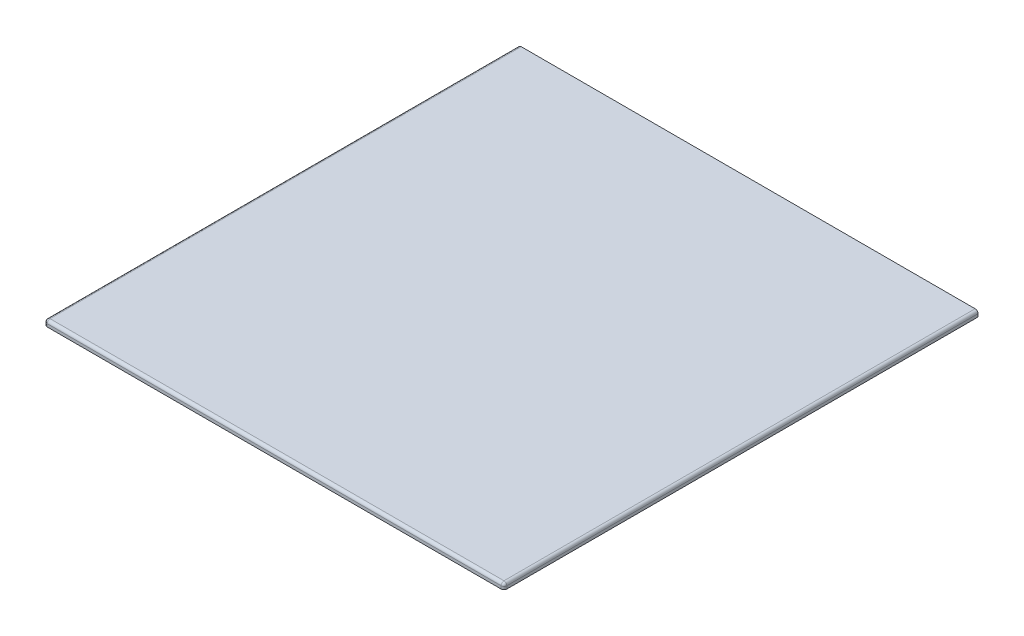
ISO-10303-21;
HEADER;
FILE_DESCRIPTION(('STEP AP214'),'2;1');
FILE_NAME('part.step','',(''),(''),'','','');
FILE_SCHEMA(('AUTOMOTIVE_DESIGN { 1 0 10303 214 1 1 1 1 }'));
ENDSEC;
DATA;
#1=APPLICATION_CONTEXT('core data for automotive mechanical design processes');
#2=APPLICATION_PROTOCOL_DEFINITION('international standard','automotive_design',2000,#1);
#3=PRODUCT_CONTEXT('',#1,'mechanical');
#4=PRODUCT('Part','Part','',(#3));
#5=PRODUCT_RELATED_PRODUCT_CATEGORY('part','',(#4));
#6=PRODUCT_DEFINITION_FORMATION('','',#4);
#7=PRODUCT_DEFINITION_CONTEXT('part definition',#1,'design');
#8=PRODUCT_DEFINITION('design','',#6,#7);
#9=PRODUCT_DEFINITION_SHAPE('','',#8);
#10=(LENGTH_UNIT() NAMED_UNIT(*) SI_UNIT(.MILLI.,.METRE.));
#11=(NAMED_UNIT(*) PLANE_ANGLE_UNIT() SI_UNIT($,.RADIAN.));
#12=(NAMED_UNIT(*) SI_UNIT($,.STERADIAN.) SOLID_ANGLE_UNIT());
#13=UNCERTAINTY_MEASURE_WITH_UNIT(LENGTH_MEASURE(1.E-05),#10,'distance_accuracy_value','');
#14=(GEOMETRIC_REPRESENTATION_CONTEXT(3) GLOBAL_UNCERTAINTY_ASSIGNED_CONTEXT((#13)) GLOBAL_UNIT_ASSIGNED_CONTEXT((#10,
#11,#12)) REPRESENTATION_CONTEXT('',''));
#15=CARTESIAN_POINT('',(0.,0.,0.));
#16=DIRECTION('',(0.,0.,1.));
#17=DIRECTION('',(1.,0.,0.));
#18=AXIS2_PLACEMENT_3D('',#15,#16,#17);
#19=CARTESIAN_POINT('',(508.,6.35,0.));
#20=DIRECTION('',(0.,1.,0.));
#21=DIRECTION('',(0.,0.,1.));
#22=AXIS2_PLACEMENT_3D('',#19,#20,#21);
#23=PLANE('',#22);
#24=DIRECTION('',(0.,0.,-1.));
#25=VECTOR('',#24,1.);
#26=CARTESIAN_POINT('',(3.175,6.35,1206.79845));
#27=LINE('',#26,#25);
#28=CARTESIAN_POINT('',(3.17500000000002,6.35,520.7));
#29=VERTEX_POINT('',#28);
#30=CARTESIAN_POINT('',(3.175,6.35,0.));
#31=VERTEX_POINT('',#30);
#32=EDGE_CURVE('E162',#29,#31,#27,.T.);
#33=ORIENTED_EDGE('',*,*,#32,.F.);
#34=DIRECTION('',(-1.,0.,0.));
#35=VECTOR('',#34,1.);
#36=CARTESIAN_POINT('',(505.94709213478,6.35,520.7));
#37=LINE('',#36,#35);
#38=CARTESIAN_POINT('',(504.825,6.35000000000001,520.700000000022));
#39=VERTEX_POINT('',#38);
#40=EDGE_CURVE('E166',#39,#29,#37,.T.);
#41=ORIENTED_EDGE('',*,*,#40,.F.);
#42=DIRECTION('',(0.,0.,-1.));
#43=VECTOR('',#42,1.);
#44=CARTESIAN_POINT('',(504.825,6.35,1206.79845));
#45=LINE('',#44,#43);
#46=CARTESIAN_POINT('',(504.825,6.35,0.));
#47=VERTEX_POINT('',#46);
#48=EDGE_CURVE('E93',#47,#39,#45,.F.);
#49=ORIENTED_EDGE('',*,*,#48,.F.);
#50=DIRECTION('',(1.,0.,0.));
#51=VECTOR('',#50,1.);
#52=CARTESIAN_POINT('',(0.,6.35,0.));
#53=LINE('',#52,#51);
#54=EDGE_CURVE('E136',#47,#31,#53,.F.);
#55=ORIENTED_EDGE('',*,*,#54,.T.);
#56=EDGE_LOOP('',(#33,#41,#49,#55));
#57=FACE_BOUND('',#56,.T.);
#58=ADVANCED_FACE('F16',(#57),#23,.T.);
#59=CARTESIAN_POINT('',(3.175,3.175,1206.79845));
#60=DIRECTION('',(0.,0.,-1.));
#61=DIRECTION('',(-1.,0.,0.));
#62=AXIS2_PLACEMENT_3D('',#59,#60,#61);
#63=CYLINDRICAL_SURFACE('',#62,3.175);
#64=DIRECTION('',(0.,0.,1.));
#65=VECTOR('',#64,1.);
#66=CARTESIAN_POINT('',(0.,3.17500000004318,0.));
#67=LINE('',#66,#65);
#68=CARTESIAN_POINT('',(0.,3.17500000002159,520.700000000195));
#69=VERTEX_POINT('',#68);
#70=CARTESIAN_POINT('',(0.,3.17500000002159,0.));
#71=VERTEX_POINT('',#70);
#72=EDGE_CURVE('E177',#69,#71,#67,.F.);
#73=ORIENTED_EDGE('',*,*,#72,.F.);
#74=CARTESIAN_POINT('',(3.17499999999998,3.17500000000004,520.7));
#75=DIRECTION('',(1.22590104734144E-10,1.22590104734144E-10,1.));
#76=DIRECTION('',(-0.707106781182498,0.707106781190598,0.));
#77=AXIS2_PLACEMENT_3D('',#74,#75,#76);
#78=CIRCLE('',#77,3.175);
#79=CARTESIAN_POINT('',(0.92993596974557,5.42006403028015,520.7));
#80=VERTEX_POINT('',#79);
#81=EDGE_CURVE('E141',#80,#69,#78,.T.);
#82=ORIENTED_EDGE('',*,*,#81,.F.);
#83=CARTESIAN_POINT('',(3.175,3.175,520.7));
#84=DIRECTION('',(0.,0.,-1.));
#85=DIRECTION('',(-1.,0.,0.));
#86=AXIS2_PLACEMENT_3D('',#83,#84,#85);
#87=CIRCLE('',#86,3.175);
#88=EDGE_CURVE('E180',#29,#80,#87,.F.);
#89=ORIENTED_EDGE('',*,*,#88,.F.);
#90=ORIENTED_EDGE('',*,*,#32,.T.);
#91=CARTESIAN_POINT('',(3.175,3.175,0.));
#92=DIRECTION('',(0.,0.,-1.));
#93=DIRECTION('',(-1.,0.,0.));
#94=AXIS2_PLACEMENT_3D('',#91,#92,#93);
#95=CIRCLE('',#94,3.175);
#96=EDGE_CURVE('E133',#31,#71,#95,.F.);
#97=ORIENTED_EDGE('',*,*,#96,.T.);
#98=EDGE_LOOP('',(#73,#82,#89,#90,#97));
#99=FACE_BOUND('',#98,.T.);
#100=ADVANCED_FACE('F214',(#99),#63,.T.);
#101=CARTESIAN_POINT('',(504.825,3.175,1206.79845));
#102=DIRECTION('',(0.,0.,-1.));
#103=DIRECTION('',(-1.,0.,0.));
#104=AXIS2_PLACEMENT_3D('',#101,#102,#103);
#105=CYLINDRICAL_SURFACE('',#104,3.175);
#106=ORIENTED_EDGE('',*,*,#48,.T.);
#107=CARTESIAN_POINT('',(504.825,3.17500000000004,520.7));
#108=DIRECTION('',(1.41821554500154E-11,-1.41821554500154E-11,1.));
#109=DIRECTION('',(0.707106781190598,0.707106781182498,0.));
#110=AXIS2_PLACEMENT_3D('',#107,#108,#109);
#111=CIRCLE('',#110,3.175);
#112=CARTESIAN_POINT('',(507.07006403028,5.42006403025443,520.7));
#113=VERTEX_POINT('',#112);
#114=EDGE_CURVE('E90',#113,#39,#111,.T.);
#115=ORIENTED_EDGE('',*,*,#114,.F.);
#116=CARTESIAN_POINT('',(504.825,3.175,520.7));
#117=DIRECTION('',(0.,0.,-1.));
#118=DIRECTION('',(-1.,0.,0.));
#119=AXIS2_PLACEMENT_3D('',#116,#117,#118);
#120=CIRCLE('',#119,3.175);
#121=CARTESIAN_POINT('',(508.,3.175,520.7));
#122=VERTEX_POINT('',#121);
#123=EDGE_CURVE('E19',#122,#113,#120,.F.);
#124=ORIENTED_EDGE('',*,*,#123,.F.);
#125=DIRECTION('',(0.,0.,-1.));
#126=VECTOR('',#125,1.);
#127=CARTESIAN_POINT('',(508.,3.175,0.));
#128=LINE('',#127,#126);
#129=CARTESIAN_POINT('',(508.,3.175,0.));
#130=VERTEX_POINT('',#129);
#131=EDGE_CURVE('E87',#130,#122,#128,.F.);
#132=ORIENTED_EDGE('',*,*,#131,.F.);
#133=CARTESIAN_POINT('',(504.825,3.175,0.));
#134=DIRECTION('',(0.,0.,-1.));
#135=DIRECTION('',(-1.,0.,0.));
#136=AXIS2_PLACEMENT_3D('',#133,#134,#135);
#137=CIRCLE('',#136,3.175);
#138=EDGE_CURVE('E138',#130,#47,#137,.F.);
#139=ORIENTED_EDGE('',*,*,#138,.T.);
#140=EDGE_LOOP('',(#106,#115,#124,#132,#139));
#141=FACE_BOUND('',#140,.T.);
#142=ADVANCED_FACE('F85',(#141),#105,.T.);
#143=CARTESIAN_POINT('',(504.825,3.175,520.7));
#144=DIRECTION('',(0.707106781190598,0.707106781182498,0.));
#145=DIRECTION('',(0.,0.,1.));
#146=AXIS2_PLACEMENT_3D('',#143,#144,#145);
#147=SPHERICAL_SURFACE('',#146,3.175);
#148=ORIENTED_EDGE('',*,*,#123,.T.);
#149=ORIENTED_EDGE('',*,*,#114,.T.);
#150=CARTESIAN_POINT('',(504.825,3.175,520.7));
#151=DIRECTION('',(-1.,0.,0.));
#152=DIRECTION('',(0.,0.,1.));
#153=AXIS2_PLACEMENT_3D('',#150,#151,#152);
#154=CIRCLE('',#153,3.175);
#155=CARTESIAN_POINT('',(504.825,3.175,523.875));
#156=VERTEX_POINT('',#155);
#157=EDGE_CURVE('E107',#156,#39,#154,.T.);
#158=ORIENTED_EDGE('',*,*,#157,.F.);
#159=CARTESIAN_POINT('',(504.825,3.175,520.7));
#160=DIRECTION('',(0.,1.,0.));
#161=DIRECTION('',(0.,0.,1.));
#162=AXIS2_PLACEMENT_3D('',#159,#160,#161);
#163=CIRCLE('',#162,3.175);
#164=EDGE_CURVE('E104',#122,#156,#163,.F.);
#165=ORIENTED_EDGE('',*,*,#164,.F.);
#166=EDGE_LOOP('',(#148,#149,#158,#165));
#167=FACE_BOUND('',#166,.T.);
#168=ADVANCED_FACE('F105',(#167),#147,.T.);
#169=CARTESIAN_POINT('',(505.94709213478,3.175,520.7));
#170=DIRECTION('',(-1.,0.,0.));
#171=DIRECTION('',(0.,0.,1.));
#172=AXIS2_PLACEMENT_3D('',#169,#170,#171);
#173=CYLINDRICAL_SURFACE('',#172,3.175);
#174=CARTESIAN_POINT('',(3.17500000000004,3.175,520.7));
#175=DIRECTION('',(-1.,0.,0.));
#176=DIRECTION('',(0.,0.,1.));
#177=AXIS2_PLACEMENT_3D('',#174,#175,#176);
#178=CIRCLE('',#177,3.175);
#179=CARTESIAN_POINT('',(3.17500000000002,3.175,523.875));
#180=VERTEX_POINT('',#179);
#181=EDGE_CURVE('E168',#180,#29,#178,.T.);
#182=ORIENTED_EDGE('',*,*,#181,.F.);
#183=DIRECTION('',(1.,0.,0.));
#184=VECTOR('',#183,1.);
#185=CARTESIAN_POINT('',(0.,3.175,523.875));
#186=LINE('',#185,#184);
#187=EDGE_CURVE('E160',#156,#180,#186,.F.);
#188=ORIENTED_EDGE('',*,*,#187,.F.);
#189=ORIENTED_EDGE('',*,*,#157,.T.);
#190=ORIENTED_EDGE('',*,*,#40,.T.);
#191=EDGE_LOOP('',(#182,#188,#189,#190));
#192=FACE_BOUND('',#191,.T.);
#193=ADVANCED_FACE('F149',(#192),#173,.T.);
#194=CARTESIAN_POINT('',(3.175,3.175,520.7));
#195=DIRECTION('',(-0.707106781182498,0.707106781190598,0.));
#196=DIRECTION('',(0.,0.,1.));
#197=AXIS2_PLACEMENT_3D('',#194,#195,#196);
#198=SPHERICAL_SURFACE('',#197,3.175);
#199=ORIENTED_EDGE('',*,*,#88,.T.);
#200=ORIENTED_EDGE('',*,*,#81,.T.);
#201=CARTESIAN_POINT('',(3.175,3.175,520.7));
#202=DIRECTION('',(0.,-1.,0.));
#203=DIRECTION('',(0.,0.,-1.));
#204=AXIS2_PLACEMENT_3D('',#201,#202,#203);
#205=CIRCLE('',#204,3.175);
#206=EDGE_CURVE('E171',#180,#69,#205,.T.);
#207=ORIENTED_EDGE('',*,*,#206,.F.);
#208=ORIENTED_EDGE('',*,*,#181,.T.);
#209=EDGE_LOOP('',(#199,#200,#207,#208));
#210=FACE_BOUND('',#209,.T.);
#211=ADVANCED_FACE('F144',(#210),#198,.T.);
#212=CARTESIAN_POINT('',(0.,6.35,0.));
#213=DIRECTION('',(-1.,0.,0.));
#214=DIRECTION('',(0.,0.,1.));
#215=AXIS2_PLACEMENT_3D('',#212,#213,#214);
#216=PLANE('',#215);
#217=DIRECTION('',(0.,0.,-1.));
#218=VECTOR('',#217,1.);
#219=CARTESIAN_POINT('',(0.,0.,0.));
#220=LINE('',#219,#218);
#221=CARTESIAN_POINT('',(0.,0.,520.7));
#222=VERTEX_POINT('',#221);
#223=CARTESIAN_POINT('',(0.,0.,0.));
#224=VERTEX_POINT('',#223);
#225=EDGE_CURVE('E128',#222,#224,#220,.T.);
#226=ORIENTED_EDGE('',*,*,#225,.F.);
#227=DIRECTION('',(0.,-1.,0.));
#228=VECTOR('',#227,1.);
#229=CARTESIAN_POINT('',(0.,4.29709213473682,520.7));
#230=LINE('',#229,#228);
#231=EDGE_CURVE('E173',#69,#222,#230,.T.);
#232=ORIENTED_EDGE('',*,*,#231,.F.);
#233=ORIENTED_EDGE('',*,*,#72,.T.);
#234=DIRECTION('',(0.,1.,0.));
#235=VECTOR('',#234,1.);
#236=CARTESIAN_POINT('',(0.,0.,0.));
#237=LINE('',#236,#235);
#238=EDGE_CURVE('E121',#71,#224,#237,.F.);
#239=ORIENTED_EDGE('',*,*,#238,.T.);
#240=EDGE_LOOP('',(#226,#232,#233,#239));
#241=FACE_BOUND('',#240,.T.);
#242=ADVANCED_FACE('F148',(#241),#216,.T.);
#243=CARTESIAN_POINT('',(0.,0.,0.));
#244=DIRECTION('',(0.,0.,1.));
#245=DIRECTION('',(1.,0.,0.));
#246=AXIS2_PLACEMENT_3D('',#243,#244,#245);
#247=PLANE('',#246);
#248=DIRECTION('',(1.,0.,0.));
#249=VECTOR('',#248,1.);
#250=CARTESIAN_POINT('',(0.,0.,0.));
#251=LINE('',#250,#249);
#252=CARTESIAN_POINT('',(508.,0.,0.));
#253=VERTEX_POINT('',#252);
#254=EDGE_CURVE('E124',#224,#253,#251,.T.);
#255=ORIENTED_EDGE('',*,*,#254,.F.);
#256=ORIENTED_EDGE('',*,*,#238,.F.);
#257=ORIENTED_EDGE('',*,*,#96,.F.);
#258=ORIENTED_EDGE('',*,*,#54,.F.);
#259=ORIENTED_EDGE('',*,*,#138,.F.);
#260=DIRECTION('',(0.,1.,0.));
#261=VECTOR('',#260,1.);
#262=CARTESIAN_POINT('',(508.,0.,0.));
#263=LINE('',#262,#261);
#264=EDGE_CURVE('E101',#253,#130,#263,.T.);
#265=ORIENTED_EDGE('',*,*,#264,.F.);
#266=EDGE_LOOP('',(#255,#256,#257,#258,#259,#265));
#267=FACE_BOUND('',#266,.T.);
#268=ADVANCED_FACE('F210',(#267),#247,.F.);
#269=CARTESIAN_POINT('',(508.,0.,0.));
#270=DIRECTION('',(1.,0.,0.));
#271=DIRECTION('',(0.,0.,-1.));
#272=AXIS2_PLACEMENT_3D('',#269,#270,#271);
#273=PLANE('',#272);
#274=ORIENTED_EDGE('',*,*,#131,.T.);
#275=DIRECTION('',(0.,1.,0.));
#276=VECTOR('',#275,1.);
#277=CARTESIAN_POINT('',(508.,-8.27786,520.7));
#278=LINE('',#277,#276);
#279=CARTESIAN_POINT('',(508.,0.,520.7));
#280=VERTEX_POINT('',#279);
#281=EDGE_CURVE('E98',#280,#122,#278,.T.);
#282=ORIENTED_EDGE('',*,*,#281,.F.);
#283=DIRECTION('',(0.,0.,-1.));
#284=VECTOR('',#283,1.);
#285=CARTESIAN_POINT('',(508.,0.,0.));
#286=LINE('',#285,#284);
#287=EDGE_CURVE('E127',#253,#280,#286,.F.);
#288=ORIENTED_EDGE('',*,*,#287,.F.);
#289=ORIENTED_EDGE('',*,*,#264,.T.);
#290=EDGE_LOOP('',(#274,#282,#288,#289));
#291=FACE_BOUND('',#290,.T.);
#292=ADVANCED_FACE('F95',(#291),#273,.T.);
#293=CARTESIAN_POINT('',(504.825,-8.27786,520.7));
#294=DIRECTION('',(0.,1.,0.));
#295=DIRECTION('',(0.,0.,1.));
#296=AXIS2_PLACEMENT_3D('',#293,#294,#295);
#297=CYLINDRICAL_SURFACE('',#296,3.175);
#298=DIRECTION('',(0.,1.,0.));
#299=VECTOR('',#298,1.);
#300=CARTESIAN_POINT('',(504.825,0.,523.875));
#301=LINE('',#300,#299);
#302=CARTESIAN_POINT('',(504.825,0.,523.875));
#303=VERTEX_POINT('',#302);
#304=EDGE_CURVE('E110',#303,#156,#301,.T.);
#305=ORIENTED_EDGE('',*,*,#304,.F.);
#306=CARTESIAN_POINT('',(504.825,0.,520.7));
#307=DIRECTION('',(0.,1.,0.));
#308=DIRECTION('',(0.,0.,1.));
#309=AXIS2_PLACEMENT_3D('',#306,#307,#308);
#310=CIRCLE('',#309,3.175);
#311=EDGE_CURVE('E114',#280,#303,#310,.F.);
#312=ORIENTED_EDGE('',*,*,#311,.F.);
#313=ORIENTED_EDGE('',*,*,#281,.T.);
#314=ORIENTED_EDGE('',*,*,#164,.T.);
#315=EDGE_LOOP('',(#305,#312,#313,#314));
#316=FACE_BOUND('',#315,.T.);
#317=ADVANCED_FACE('F112',(#316),#297,.T.);
#318=CARTESIAN_POINT('',(0.,0.,523.875));
#319=DIRECTION('',(0.,0.,1.));
#320=DIRECTION('',(1.,0.,0.));
#321=AXIS2_PLACEMENT_3D('',#318,#319,#320);
#322=PLANE('',#321);
#323=ORIENTED_EDGE('',*,*,#187,.T.);
#324=DIRECTION('',(0.,-1.,0.));
#325=VECTOR('',#324,1.);
#326=CARTESIAN_POINT('',(3.175,4.29709213473682,523.875));
#327=LINE('',#326,#325);
#328=CARTESIAN_POINT('',(3.175,0.,523.875));
#329=VERTEX_POINT('',#328);
#330=EDGE_CURVE('E34',#329,#180,#327,.F.);
#331=ORIENTED_EDGE('',*,*,#330,.F.);
#332=DIRECTION('',(1.,0.,0.));
#333=VECTOR('',#332,1.);
#334=CARTESIAN_POINT('',(0.,0.,523.875));
#335=LINE('',#334,#333);
#336=EDGE_CURVE('E25',#303,#329,#335,.F.);
#337=ORIENTED_EDGE('',*,*,#336,.F.);
#338=ORIENTED_EDGE('',*,*,#304,.T.);
#339=EDGE_LOOP('',(#323,#331,#337,#338));
#340=FACE_BOUND('',#339,.T.);
#341=ADVANCED_FACE('F188',(#340),#322,.T.);
#342=CARTESIAN_POINT('',(3.175,4.29709213473682,520.7));
#343=DIRECTION('',(0.,-1.,0.));
#344=DIRECTION('',(0.,0.,-1.));
#345=AXIS2_PLACEMENT_3D('',#342,#343,#344);
#346=CYLINDRICAL_SURFACE('',#345,3.175);
#347=ORIENTED_EDGE('',*,*,#231,.T.);
#348=CARTESIAN_POINT('',(3.175,0.,520.7));
#349=DIRECTION('',(0.,-1.,0.));
#350=DIRECTION('',(0.,0.,-1.));
#351=AXIS2_PLACEMENT_3D('',#348,#349,#350);
#352=CIRCLE('',#351,3.175);
#353=EDGE_CURVE('E11',#329,#222,#352,.T.);
#354=ORIENTED_EDGE('',*,*,#353,.F.);
#355=ORIENTED_EDGE('',*,*,#330,.T.);
#356=ORIENTED_EDGE('',*,*,#206,.T.);
#357=EDGE_LOOP('',(#347,#354,#355,#356));
#358=FACE_BOUND('',#357,.T.);
#359=ADVANCED_FACE('F204',(#358),#346,.T.);
#360=CARTESIAN_POINT('',(0.,0.,0.));
#361=DIRECTION('',(0.,-1.,0.));
#362=DIRECTION('',(0.,0.,-1.));
#363=AXIS2_PLACEMENT_3D('',#360,#361,#362);
#364=PLANE('',#363);
#365=ORIENTED_EDGE('',*,*,#336,.T.);
#366=ORIENTED_EDGE('',*,*,#353,.T.);
#367=ORIENTED_EDGE('',*,*,#225,.T.);
#368=ORIENTED_EDGE('',*,*,#254,.T.);
#369=ORIENTED_EDGE('',*,*,#287,.T.);
#370=ORIENTED_EDGE('',*,*,#311,.T.);
#371=EDGE_LOOP('',(#365,#366,#367,#368,#369,#370));
#372=FACE_BOUND('',#371,.T.);
#373=ADVANCED_FACE('F192',(#372),#364,.T.);
#374=CLOSED_SHELL('',(#58,#100,#142,#168,#193,#211,#242,#268,#292,#317,#341,#359,#373));
#375=MANIFOLD_SOLID_BREP('B1',#374);
#376=ADVANCED_BREP_SHAPE_REPRESENTATION('',(#18,#375),#14);
#377=SHAPE_DEFINITION_REPRESENTATION(#9,#376);
ENDSEC;
END-ISO-10303-21;
